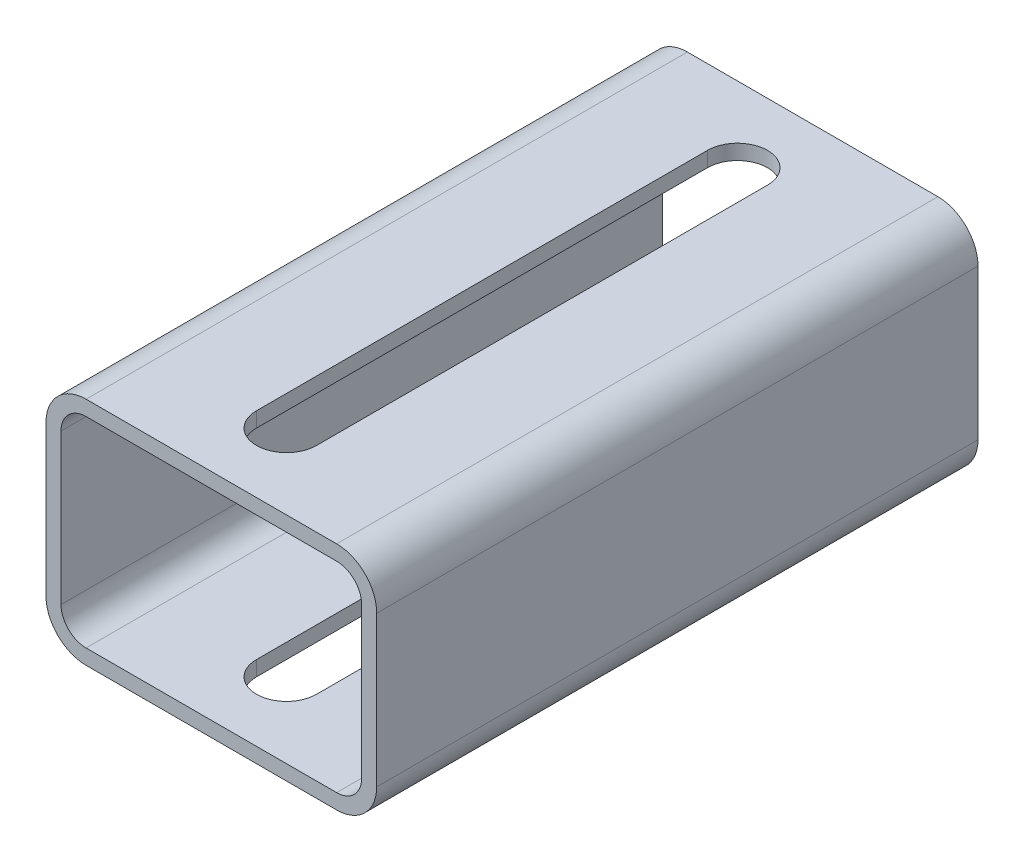
ISO-10303-21;
HEADER;
FILE_DESCRIPTION(('STEP AP214'),'2;1');
FILE_NAME('part.step','',(''),(''),'','','');
FILE_SCHEMA(('AUTOMOTIVE_DESIGN { 1 0 10303 214 1 1 1 1 }'));
ENDSEC;
DATA;
#1=APPLICATION_CONTEXT('core data for automotive mechanical design processes');
#2=APPLICATION_PROTOCOL_DEFINITION('international standard','automotive_design',2000,#1);
#3=PRODUCT_CONTEXT('',#1,'mechanical');
#4=PRODUCT('Part','Part','',(#3));
#5=PRODUCT_RELATED_PRODUCT_CATEGORY('part','',(#4));
#6=PRODUCT_DEFINITION_FORMATION('','',#4);
#7=PRODUCT_DEFINITION_CONTEXT('part definition',#1,'design');
#8=PRODUCT_DEFINITION('design','',#6,#7);
#9=PRODUCT_DEFINITION_SHAPE('','',#8);
#10=(LENGTH_UNIT() NAMED_UNIT(*) SI_UNIT(.MILLI.,.METRE.));
#11=(NAMED_UNIT(*) PLANE_ANGLE_UNIT() SI_UNIT($,.RADIAN.));
#12=(NAMED_UNIT(*) SI_UNIT($,.STERADIAN.) SOLID_ANGLE_UNIT());
#13=UNCERTAINTY_MEASURE_WITH_UNIT(LENGTH_MEASURE(1.E-05),#10,'distance_accuracy_value','');
#14=(GEOMETRIC_REPRESENTATION_CONTEXT(3) GLOBAL_UNCERTAINTY_ASSIGNED_CONTEXT((#13)) GLOBAL_UNIT_ASSIGNED_CONTEXT((#10,
#11,#12)) REPRESENTATION_CONTEXT('',''));
#15=CARTESIAN_POINT('',(0.,0.,0.));
#16=DIRECTION('',(0.,0.,1.));
#17=DIRECTION('',(1.,0.,0.));
#18=AXIS2_PLACEMENT_3D('',#15,#16,#17);
#19=CARTESIAN_POINT('',(25.,23.,60.));
#20=DIRECTION('',(0.,1.,0.));
#21=DIRECTION('',(0.,0.,1.));
#22=AXIS2_PLACEMENT_3D('',#19,#20,#21);
#23=PLANE('',#22);
#24=CARTESIAN_POINT('',(0.,23.,-45.));
#25=DIRECTION('',(0.,1.,0.));
#26=DIRECTION('',(0.,0.,1.));
#27=AXIS2_PLACEMENT_3D('',#24,#25,#26);
#28=CIRCLE('',#27,6.);
#29=CARTESIAN_POINT('',(6.,23.,-45.));
#30=VERTEX_POINT('',#29);
#31=CARTESIAN_POINT('',(-6.,23.,-45.));
#32=VERTEX_POINT('',#31);
#33=EDGE_CURVE('E90',#30,#32,#28,.T.);
#34=ORIENTED_EDGE('',*,*,#33,.F.);
#35=DIRECTION('',(0.,0.,-1.));
#36=VECTOR('',#35,1.);
#37=CARTESIAN_POINT('',(6.,23.,-45.));
#38=LINE('',#37,#36);
#39=CARTESIAN_POINT('',(6.00000000000001,23.,45.));
#40=VERTEX_POINT('',#39);
#41=EDGE_CURVE('E136',#40,#30,#38,.T.);
#42=ORIENTED_EDGE('',*,*,#41,.F.);
#43=CARTESIAN_POINT('',(0.,23.,45.));
#44=DIRECTION('',(0.,1.,0.));
#45=DIRECTION('',(0.,0.,1.));
#46=AXIS2_PLACEMENT_3D('',#43,#44,#45);
#47=CIRCLE('',#46,6.);
#48=CARTESIAN_POINT('',(-5.99999999999999,23.,45.));
#49=VERTEX_POINT('',#48);
#50=EDGE_CURVE('E290',#49,#40,#47,.T.);
#51=ORIENTED_EDGE('',*,*,#50,.F.);
#52=DIRECTION('',(0.,0.,1.));
#53=VECTOR('',#52,1.);
#54=CARTESIAN_POINT('',(-6.,23.,-45.));
#55=LINE('',#54,#53);
#56=EDGE_CURVE('E285',#32,#49,#55,.T.);
#57=ORIENTED_EDGE('',*,*,#56,.F.);
#58=EDGE_LOOP('',(#34,#42,#51,#57));
#59=FACE_BOUND('',#58,.T.);
#60=DIRECTION('',(1.,0.,0.));
#61=VECTOR('',#60,1.);
#62=CARTESIAN_POINT('',(25.,23.,-60.));
#63=LINE('',#62,#61);
#64=CARTESIAN_POINT('',(-25.,23.,-60.));
#65=VERTEX_POINT('',#64);
#66=CARTESIAN_POINT('',(25.,23.,-60.));
#67=VERTEX_POINT('',#66);
#68=EDGE_CURVE('E370',#65,#67,#63,.T.);
#69=ORIENTED_EDGE('',*,*,#68,.F.);
#70=DIRECTION('',(0.,0.,-1.));
#71=VECTOR('',#70,1.);
#72=CARTESIAN_POINT('',(-25.,23.,60.));
#73=LINE('',#72,#71);
#74=CARTESIAN_POINT('',(-25.,23.,60.));
#75=VERTEX_POINT('',#74);
#76=EDGE_CURVE('E272',#75,#65,#73,.T.);
#77=ORIENTED_EDGE('',*,*,#76,.F.);
#78=DIRECTION('',(1.,0.,0.));
#79=VECTOR('',#78,1.);
#80=CARTESIAN_POINT('',(25.,23.,60.));
#81=LINE('',#80,#79);
#82=CARTESIAN_POINT('',(25.,23.,60.));
#83=VERTEX_POINT('',#82);
#84=EDGE_CURVE('E392',#75,#83,#81,.T.);
#85=ORIENTED_EDGE('',*,*,#84,.T.);
#86=DIRECTION('',(0.,0.,-1.));
#87=VECTOR('',#86,1.);
#88=CARTESIAN_POINT('',(25.,23.,60.));
#89=LINE('',#88,#87);
#90=EDGE_CURVE('E280',#83,#67,#89,.T.);
#91=ORIENTED_EDGE('',*,*,#90,.T.);
#92=EDGE_LOOP('',(#69,#77,#85,#91));
#93=FACE_BOUND('',#92,.T.);
#94=ADVANCED_FACE('F87',(#59,#93),#23,.T.);
#95=CARTESIAN_POINT('',(-25.,15.,60.));
#96=DIRECTION('',(0.,0.,-1.));
#97=DIRECTION('',(-1.,0.,0.));
#98=AXIS2_PLACEMENT_3D('',#95,#96,#97);
#99=CYLINDRICAL_SURFACE('',#98,8.);
#100=CARTESIAN_POINT('',(-25.,15.,-60.));
#101=DIRECTION('',(0.,0.,-1.));
#102=DIRECTION('',(-1.,0.,0.));
#103=AXIS2_PLACEMENT_3D('',#100,#101,#102);
#104=CIRCLE('',#103,8.);
#105=CARTESIAN_POINT('',(-33.,15.,-60.));
#106=VERTEX_POINT('',#105);
#107=EDGE_CURVE('E397',#106,#65,#104,.T.);
#108=ORIENTED_EDGE('',*,*,#107,.F.);
#109=DIRECTION('',(0.,0.,-1.));
#110=VECTOR('',#109,1.);
#111=CARTESIAN_POINT('',(-33.,15.,60.));
#112=LINE('',#111,#110);
#113=CARTESIAN_POINT('',(-33.,15.,60.));
#114=VERTEX_POINT('',#113);
#115=EDGE_CURVE('E277',#114,#106,#112,.T.);
#116=ORIENTED_EDGE('',*,*,#115,.F.);
#117=CARTESIAN_POINT('',(-25.,15.,60.));
#118=DIRECTION('',(0.,0.,-1.));
#119=DIRECTION('',(-1.,0.,0.));
#120=AXIS2_PLACEMENT_3D('',#117,#118,#119);
#121=CIRCLE('',#120,8.);
#122=EDGE_CURVE('E418',#114,#75,#121,.T.);
#123=ORIENTED_EDGE('',*,*,#122,.T.);
#124=ORIENTED_EDGE('',*,*,#76,.T.);
#125=EDGE_LOOP('',(#108,#116,#123,#124));
#126=FACE_BOUND('',#125,.T.);
#127=ADVANCED_FACE('F482',(#126),#99,.T.);
#128=CARTESIAN_POINT('',(-33.,15.,60.));
#129=DIRECTION('',(-1.,0.,0.));
#130=DIRECTION('',(0.,0.,1.));
#131=AXIS2_PLACEMENT_3D('',#128,#129,#130);
#132=PLANE('',#131);
#133=DIRECTION('',(0.,1.,0.));
#134=VECTOR('',#133,1.);
#135=CARTESIAN_POINT('',(-33.,15.,-60.));
#136=LINE('',#135,#134);
#137=CARTESIAN_POINT('',(-33.,-15.,-60.));
#138=VERTEX_POINT('',#137);
#139=EDGE_CURVE('E443',#138,#106,#136,.T.);
#140=ORIENTED_EDGE('',*,*,#139,.F.);
#141=DIRECTION('',(0.,0.,-1.));
#142=VECTOR('',#141,1.);
#143=CARTESIAN_POINT('',(-33.,-15.,60.));
#144=LINE('',#143,#142);
#145=CARTESIAN_POINT('',(-33.,-15.,60.));
#146=VERTEX_POINT('',#145);
#147=EDGE_CURVE('E452',#146,#138,#144,.T.);
#148=ORIENTED_EDGE('',*,*,#147,.F.);
#149=DIRECTION('',(0.,1.,0.));
#150=VECTOR('',#149,1.);
#151=CARTESIAN_POINT('',(-33.,15.,60.));
#152=LINE('',#151,#150);
#153=EDGE_CURVE('E414',#146,#114,#152,.T.);
#154=ORIENTED_EDGE('',*,*,#153,.T.);
#155=ORIENTED_EDGE('',*,*,#115,.T.);
#156=EDGE_LOOP('',(#140,#148,#154,#155));
#157=FACE_BOUND('',#156,.T.);
#158=ADVANCED_FACE('F505',(#157),#132,.T.);
#159=CARTESIAN_POINT('',(-25.,-15.,60.));
#160=DIRECTION('',(0.,0.,-1.));
#161=DIRECTION('',(-1.,0.,0.));
#162=AXIS2_PLACEMENT_3D('',#159,#160,#161);
#163=CYLINDRICAL_SURFACE('',#162,8.);
#164=CARTESIAN_POINT('',(-25.,-15.,-60.));
#165=DIRECTION('',(0.,0.,-1.));
#166=DIRECTION('',(-1.,0.,0.));
#167=AXIS2_PLACEMENT_3D('',#164,#165,#166);
#168=CIRCLE('',#167,8.);
#169=CARTESIAN_POINT('',(-25.,-23.,-60.));
#170=VERTEX_POINT('',#169);
#171=EDGE_CURVE('E439',#170,#138,#168,.T.);
#172=ORIENTED_EDGE('',*,*,#171,.F.);
#173=DIRECTION('',(0.,0.,-1.));
#174=VECTOR('',#173,1.);
#175=CARTESIAN_POINT('',(-25.,-23.,60.));
#176=LINE('',#175,#174);
#177=CARTESIAN_POINT('',(-25.,-23.,60.));
#178=VERTEX_POINT('',#177);
#179=EDGE_CURVE('E455',#178,#170,#176,.T.);
#180=ORIENTED_EDGE('',*,*,#179,.F.);
#181=CARTESIAN_POINT('',(-25.,-15.,60.));
#182=DIRECTION('',(0.,0.,-1.));
#183=DIRECTION('',(-1.,0.,0.));
#184=AXIS2_PLACEMENT_3D('',#181,#182,#183);
#185=CIRCLE('',#184,8.);
#186=EDGE_CURVE('E410',#178,#146,#185,.T.);
#187=ORIENTED_EDGE('',*,*,#186,.T.);
#188=ORIENTED_EDGE('',*,*,#147,.T.);
#189=EDGE_LOOP('',(#172,#180,#187,#188));
#190=FACE_BOUND('',#189,.T.);
#191=ADVANCED_FACE('F503',(#190),#163,.T.);
#192=CARTESIAN_POINT('',(25.,-23.,60.));
#193=DIRECTION('',(0.,1.,0.));
#194=DIRECTION('',(-1.,0.,0.));
#195=AXIS2_PLACEMENT_3D('',#192,#193,#194);
#196=PLANE('',#195);
#197=DIRECTION('',(0.,0.,-1.));
#198=VECTOR('',#197,1.);
#199=CARTESIAN_POINT('',(6.,-23.,-45.));
#200=LINE('',#199,#198);
#201=CARTESIAN_POINT('',(6.00000000000001,-23.,45.));
#202=VERTEX_POINT('',#201);
#203=CARTESIAN_POINT('',(6.,-23.,-45.));
#204=VERTEX_POINT('',#203);
#205=EDGE_CURVE('E559',#202,#204,#200,.T.);
#206=ORIENTED_EDGE('',*,*,#205,.T.);
#207=CARTESIAN_POINT('',(0.,-23.,-45.));
#208=DIRECTION('',(0.,1.,0.));
#209=DIRECTION('',(0.,0.,1.));
#210=AXIS2_PLACEMENT_3D('',#207,#208,#209);
#211=CIRCLE('',#210,6.);
#212=CARTESIAN_POINT('',(-6.,-23.,-45.));
#213=VERTEX_POINT('',#212);
#214=EDGE_CURVE('E565',#204,#213,#211,.T.);
#215=ORIENTED_EDGE('',*,*,#214,.T.);
#216=DIRECTION('',(0.,0.,1.));
#217=VECTOR('',#216,1.);
#218=CARTESIAN_POINT('',(-6.,-23.,-45.));
#219=LINE('',#218,#217);
#220=CARTESIAN_POINT('',(-5.99999999999999,-23.,45.));
#221=VERTEX_POINT('',#220);
#222=EDGE_CURVE('E252',#213,#221,#219,.T.);
#223=ORIENTED_EDGE('',*,*,#222,.T.);
#224=CARTESIAN_POINT('',(0.,-23.,45.));
#225=DIRECTION('',(0.,1.,0.));
#226=DIRECTION('',(0.,0.,1.));
#227=AXIS2_PLACEMENT_3D('',#224,#225,#226);
#228=CIRCLE('',#227,6.);
#229=EDGE_CURVE('E113',#221,#202,#228,.T.);
#230=ORIENTED_EDGE('',*,*,#229,.T.);
#231=EDGE_LOOP('',(#206,#215,#223,#230));
#232=FACE_BOUND('',#231,.T.);
#233=DIRECTION('',(1.,0.,0.));
#234=VECTOR('',#233,1.);
#235=CARTESIAN_POINT('',(25.,-23.,-60.));
#236=LINE('',#235,#234);
#237=CARTESIAN_POINT('',(25.,-23.,-60.));
#238=VERTEX_POINT('',#237);
#239=EDGE_CURVE('E436',#170,#238,#236,.T.);
#240=ORIENTED_EDGE('',*,*,#239,.T.);
#241=DIRECTION('',(0.,0.,-1.));
#242=VECTOR('',#241,1.);
#243=CARTESIAN_POINT('',(25.,-23.,60.));
#244=LINE('',#243,#242);
#245=CARTESIAN_POINT('',(25.,-23.,60.));
#246=VERTEX_POINT('',#245);
#247=EDGE_CURVE('E458',#246,#238,#244,.T.);
#248=ORIENTED_EDGE('',*,*,#247,.F.);
#249=DIRECTION('',(1.,0.,0.));
#250=VECTOR('',#249,1.);
#251=CARTESIAN_POINT('',(25.,-23.,60.));
#252=LINE('',#251,#250);
#253=EDGE_CURVE('E407',#178,#246,#252,.T.);
#254=ORIENTED_EDGE('',*,*,#253,.F.);
#255=ORIENTED_EDGE('',*,*,#179,.T.);
#256=EDGE_LOOP('',(#240,#248,#254,#255));
#257=FACE_BOUND('',#256,.T.);
#258=ADVANCED_FACE('F500',(#232,#257),#196,.F.);
#259=CARTESIAN_POINT('',(25.,-15.,60.));
#260=DIRECTION('',(0.,0.,-1.));
#261=DIRECTION('',(-1.,0.,0.));
#262=AXIS2_PLACEMENT_3D('',#259,#260,#261);
#263=CYLINDRICAL_SURFACE('',#262,8.00000000000001);
#264=CARTESIAN_POINT('',(25.,-15.,-60.));
#265=DIRECTION('',(0.,0.,-1.));
#266=DIRECTION('',(-1.,0.,0.));
#267=AXIS2_PLACEMENT_3D('',#264,#265,#266);
#268=CIRCLE('',#267,8.00000000000001);
#269=CARTESIAN_POINT('',(33.,-15.,-60.));
#270=VERTEX_POINT('',#269);
#271=EDGE_CURVE('E433',#238,#270,#268,.F.);
#272=ORIENTED_EDGE('',*,*,#271,.T.);
#273=DIRECTION('',(0.,0.,-1.));
#274=VECTOR('',#273,1.);
#275=CARTESIAN_POINT('',(33.,-15.,60.));
#276=LINE('',#275,#274);
#277=CARTESIAN_POINT('',(33.,-15.,60.));
#278=VERTEX_POINT('',#277);
#279=EDGE_CURVE('E462',#278,#270,#276,.T.);
#280=ORIENTED_EDGE('',*,*,#279,.F.);
#281=CARTESIAN_POINT('',(25.,-15.,60.));
#282=DIRECTION('',(0.,0.,-1.));
#283=DIRECTION('',(-1.,0.,0.));
#284=AXIS2_PLACEMENT_3D('',#281,#282,#283);
#285=CIRCLE('',#284,8.00000000000001);
#286=EDGE_CURVE('E404',#246,#278,#285,.F.);
#287=ORIENTED_EDGE('',*,*,#286,.F.);
#288=ORIENTED_EDGE('',*,*,#247,.T.);
#289=EDGE_LOOP('',(#272,#280,#287,#288));
#290=FACE_BOUND('',#289,.T.);
#291=ADVANCED_FACE('F496',(#290),#263,.T.);
#292=CARTESIAN_POINT('',(33.,15.,60.));
#293=DIRECTION('',(-1.,0.,0.));
#294=DIRECTION('',(0.,0.,1.));
#295=AXIS2_PLACEMENT_3D('',#292,#293,#294);
#296=PLANE('',#295);
#297=DIRECTION('',(0.,1.,0.));
#298=VECTOR('',#297,1.);
#299=CARTESIAN_POINT('',(33.,15.,-60.));
#300=LINE('',#299,#298);
#301=CARTESIAN_POINT('',(33.,15.,-60.));
#302=VERTEX_POINT('',#301);
#303=EDGE_CURVE('E429',#270,#302,#300,.T.);
#304=ORIENTED_EDGE('',*,*,#303,.T.);
#305=DIRECTION('',(0.,0.,-1.));
#306=VECTOR('',#305,1.);
#307=CARTESIAN_POINT('',(33.,15.,60.));
#308=LINE('',#307,#306);
#309=CARTESIAN_POINT('',(33.,15.,60.));
#310=VERTEX_POINT('',#309);
#311=EDGE_CURVE('E465',#310,#302,#308,.T.);
#312=ORIENTED_EDGE('',*,*,#311,.F.);
#313=DIRECTION('',(0.,1.,0.));
#314=VECTOR('',#313,1.);
#315=CARTESIAN_POINT('',(33.,15.,60.));
#316=LINE('',#315,#314);
#317=EDGE_CURVE('E401',#278,#310,#316,.T.);
#318=ORIENTED_EDGE('',*,*,#317,.F.);
#319=ORIENTED_EDGE('',*,*,#279,.T.);
#320=EDGE_LOOP('',(#304,#312,#318,#319));
#321=FACE_BOUND('',#320,.T.);
#322=ADVANCED_FACE('F491',(#321),#296,.F.);
#323=CARTESIAN_POINT('',(25.,15.,60.));
#324=DIRECTION('',(0.,0.,-1.));
#325=DIRECTION('',(-1.,0.,0.));
#326=AXIS2_PLACEMENT_3D('',#323,#324,#325);
#327=CYLINDRICAL_SURFACE('',#326,8.00000000000001);
#328=CARTESIAN_POINT('',(25.,15.,-60.));
#329=DIRECTION('',(0.,0.,-1.));
#330=DIRECTION('',(-1.,0.,0.));
#331=AXIS2_PLACEMENT_3D('',#328,#329,#330);
#332=CIRCLE('',#331,8.00000000000001);
#333=EDGE_CURVE('E425',#67,#302,#332,.T.);
#334=ORIENTED_EDGE('',*,*,#333,.F.);
#335=ORIENTED_EDGE('',*,*,#90,.F.);
#336=CARTESIAN_POINT('',(25.,15.,60.));
#337=DIRECTION('',(0.,0.,-1.));
#338=DIRECTION('',(-1.,0.,0.));
#339=AXIS2_PLACEMENT_3D('',#336,#337,#338);
#340=CIRCLE('',#339,8.00000000000001);
#341=EDGE_CURVE('E396',#83,#310,#340,.T.);
#342=ORIENTED_EDGE('',*,*,#341,.T.);
#343=ORIENTED_EDGE('',*,*,#311,.T.);
#344=EDGE_LOOP('',(#334,#335,#342,#343));
#345=FACE_BOUND('',#344,.T.);
#346=ADVANCED_FACE('F475',(#345),#327,.T.);
#347=CARTESIAN_POINT('',(25.,15.,60.));
#348=DIRECTION('',(0.,0.,-1.));
#349=DIRECTION('',(-1.,0.,0.));
#350=AXIS2_PLACEMENT_3D('',#347,#348,#349);
#351=PLANE('',#350);
#352=CARTESIAN_POINT('',(-25.,15.,60.));
#353=DIRECTION('',(0.,0.,-1.));
#354=DIRECTION('',(-1.,0.,0.));
#355=AXIS2_PLACEMENT_3D('',#352,#353,#354);
#356=CIRCLE('',#355,5.);
#357=CARTESIAN_POINT('',(-30.,15.,60.));
#358=VERTEX_POINT('',#357);
#359=CARTESIAN_POINT('',(-25.,20.,60.));
#360=VERTEX_POINT('',#359);
#361=EDGE_CURVE('E332',#358,#360,#356,.T.);
#362=ORIENTED_EDGE('',*,*,#361,.T.);
#363=DIRECTION('',(1.,0.,0.));
#364=VECTOR('',#363,1.);
#365=CARTESIAN_POINT('',(-25.,20.,60.));
#366=LINE('',#365,#364);
#367=CARTESIAN_POINT('',(25.,20.,60.));
#368=VERTEX_POINT('',#367);
#369=EDGE_CURVE('E305',#360,#368,#366,.T.);
#370=ORIENTED_EDGE('',*,*,#369,.T.);
#371=CARTESIAN_POINT('',(25.,15.,60.));
#372=DIRECTION('',(0.,0.,-1.));
#373=DIRECTION('',(-1.,0.,0.));
#374=AXIS2_PLACEMENT_3D('',#371,#372,#373);
#375=CIRCLE('',#374,5.00000000000001);
#376=CARTESIAN_POINT('',(30.,15.,60.));
#377=VERTEX_POINT('',#376);
#378=EDGE_CURVE('E309',#368,#377,#375,.T.);
#379=ORIENTED_EDGE('',*,*,#378,.T.);
#380=DIRECTION('',(0.,1.,0.));
#381=VECTOR('',#380,1.);
#382=CARTESIAN_POINT('',(30.,-15.,60.));
#383=LINE('',#382,#381);
#384=CARTESIAN_POINT('',(30.,-15.,60.));
#385=VERTEX_POINT('',#384);
#386=EDGE_CURVE('E314',#385,#377,#383,.T.);
#387=ORIENTED_EDGE('',*,*,#386,.F.);
#388=CARTESIAN_POINT('',(25.,-15.,60.));
#389=DIRECTION('',(0.,0.,1.));
#390=DIRECTION('',(1.,0.,0.));
#391=AXIS2_PLACEMENT_3D('',#388,#389,#390);
#392=CIRCLE('',#391,5.00000000000001);
#393=CARTESIAN_POINT('',(25.,-20.,60.));
#394=VERTEX_POINT('',#393);
#395=EDGE_CURVE('E318',#394,#385,#392,.T.);
#396=ORIENTED_EDGE('',*,*,#395,.F.);
#397=DIRECTION('',(1.,0.,0.));
#398=VECTOR('',#397,1.);
#399=CARTESIAN_POINT('',(-25.,-20.,60.));
#400=LINE('',#399,#398);
#401=CARTESIAN_POINT('',(-25.,-20.,60.));
#402=VERTEX_POINT('',#401);
#403=EDGE_CURVE('E321',#402,#394,#400,.T.);
#404=ORIENTED_EDGE('',*,*,#403,.F.);
#405=CARTESIAN_POINT('',(-25.,-15.,60.));
#406=DIRECTION('',(0.,0.,-1.));
#407=DIRECTION('',(-1.,0.,0.));
#408=AXIS2_PLACEMENT_3D('',#405,#406,#407);
#409=CIRCLE('',#408,5.);
#410=CARTESIAN_POINT('',(-30.,-15.,60.));
#411=VERTEX_POINT('',#410);
#412=EDGE_CURVE('E324',#402,#411,#409,.T.);
#413=ORIENTED_EDGE('',*,*,#412,.T.);
#414=DIRECTION('',(0.,1.,0.));
#415=VECTOR('',#414,1.);
#416=CARTESIAN_POINT('',(-30.,-15.,60.));
#417=LINE('',#416,#415);
#418=EDGE_CURVE('E328',#411,#358,#417,.T.);
#419=ORIENTED_EDGE('',*,*,#418,.T.);
#420=EDGE_LOOP('',(#362,#370,#379,#387,#396,#404,#413,#419));
#421=FACE_BOUND('',#420,.T.);
#422=ORIENTED_EDGE('',*,*,#84,.F.);
#423=ORIENTED_EDGE('',*,*,#122,.F.);
#424=ORIENTED_EDGE('',*,*,#153,.F.);
#425=ORIENTED_EDGE('',*,*,#186,.F.);
#426=ORIENTED_EDGE('',*,*,#253,.T.);
#427=ORIENTED_EDGE('',*,*,#286,.T.);
#428=ORIENTED_EDGE('',*,*,#317,.T.);
#429=ORIENTED_EDGE('',*,*,#341,.F.);
#430=EDGE_LOOP('',(#422,#423,#424,#425,#426,#427,#428,#429));
#431=FACE_BOUND('',#430,.T.);
#432=ADVANCED_FACE('F485',(#421,#431),#351,.F.);
#433=CARTESIAN_POINT('',(25.,15.,-60.));
#434=DIRECTION('',(0.,0.,-1.));
#435=DIRECTION('',(-1.,0.,0.));
#436=AXIS2_PLACEMENT_3D('',#433,#434,#435);
#437=PLANE('',#436);
#438=DIRECTION('',(1.,0.,0.));
#439=VECTOR('',#438,1.);
#440=CARTESIAN_POINT('',(-25.,20.,-60.));
#441=LINE('',#440,#439);
#442=CARTESIAN_POINT('',(-25.,20.,-60.));
#443=VERTEX_POINT('',#442);
#444=CARTESIAN_POINT('',(25.,20.,-60.));
#445=VERTEX_POINT('',#444);
#446=EDGE_CURVE('E337',#443,#445,#441,.T.);
#447=ORIENTED_EDGE('',*,*,#446,.F.);
#448=CARTESIAN_POINT('',(-25.,15.,-60.));
#449=DIRECTION('',(0.,0.,-1.));
#450=DIRECTION('',(-1.,0.,0.));
#451=AXIS2_PLACEMENT_3D('',#448,#449,#450);
#452=CIRCLE('',#451,5.);
#453=CARTESIAN_POINT('',(-30.,15.,-60.));
#454=VERTEX_POINT('',#453);
#455=EDGE_CURVE('E310',#454,#443,#452,.T.);
#456=ORIENTED_EDGE('',*,*,#455,.F.);
#457=DIRECTION('',(0.,1.,0.));
#458=VECTOR('',#457,1.);
#459=CARTESIAN_POINT('',(-30.,-15.,-60.));
#460=LINE('',#459,#458);
#461=CARTESIAN_POINT('',(-30.,-15.,-60.));
#462=VERTEX_POINT('',#461);
#463=EDGE_CURVE('E360',#462,#454,#460,.T.);
#464=ORIENTED_EDGE('',*,*,#463,.F.);
#465=CARTESIAN_POINT('',(-25.,-15.,-60.));
#466=DIRECTION('',(0.,0.,-1.));
#467=DIRECTION('',(-1.,0.,0.));
#468=AXIS2_PLACEMENT_3D('',#465,#466,#467);
#469=CIRCLE('',#468,5.);
#470=CARTESIAN_POINT('',(-25.,-20.,-60.));
#471=VERTEX_POINT('',#470);
#472=EDGE_CURVE('E356',#471,#462,#469,.T.);
#473=ORIENTED_EDGE('',*,*,#472,.F.);
#474=DIRECTION('',(1.,0.,0.));
#475=VECTOR('',#474,1.);
#476=CARTESIAN_POINT('',(-25.,-20.,-60.));
#477=LINE('',#476,#475);
#478=CARTESIAN_POINT('',(25.,-20.,-60.));
#479=VERTEX_POINT('',#478);
#480=EDGE_CURVE('E352',#471,#479,#477,.T.);
#481=ORIENTED_EDGE('',*,*,#480,.T.);
#482=CARTESIAN_POINT('',(25.,-15.,-60.));
#483=DIRECTION('',(0.,0.,1.));
#484=DIRECTION('',(1.,0.,0.));
#485=AXIS2_PLACEMENT_3D('',#482,#483,#484);
#486=CIRCLE('',#485,5.00000000000001);
#487=CARTESIAN_POINT('',(30.,-15.,-60.));
#488=VERTEX_POINT('',#487);
#489=EDGE_CURVE('E348',#479,#488,#486,.T.);
#490=ORIENTED_EDGE('',*,*,#489,.T.);
#491=DIRECTION('',(0.,1.,0.));
#492=VECTOR('',#491,1.);
#493=CARTESIAN_POINT('',(30.,-15.,-60.));
#494=LINE('',#493,#492);
#495=CARTESIAN_POINT('',(30.,15.,-60.));
#496=VERTEX_POINT('',#495);
#497=EDGE_CURVE('E344',#488,#496,#494,.T.);
#498=ORIENTED_EDGE('',*,*,#497,.T.);
#499=CARTESIAN_POINT('',(25.,15.,-60.));
#500=DIRECTION('',(0.,0.,-1.));
#501=DIRECTION('',(-1.,0.,0.));
#502=AXIS2_PLACEMENT_3D('',#499,#500,#501);
#503=CIRCLE('',#502,5.00000000000001);
#504=EDGE_CURVE('E340',#445,#496,#503,.T.);
#505=ORIENTED_EDGE('',*,*,#504,.F.);
#506=EDGE_LOOP('',(#447,#456,#464,#473,#481,#490,#498,#505));
#507=FACE_BOUND('',#506,.T.);
#508=ORIENTED_EDGE('',*,*,#68,.T.);
#509=ORIENTED_EDGE('',*,*,#333,.T.);
#510=ORIENTED_EDGE('',*,*,#303,.F.);
#511=ORIENTED_EDGE('',*,*,#271,.F.);
#512=ORIENTED_EDGE('',*,*,#239,.F.);
#513=ORIENTED_EDGE('',*,*,#171,.T.);
#514=ORIENTED_EDGE('',*,*,#139,.T.);
#515=ORIENTED_EDGE('',*,*,#107,.T.);
#516=EDGE_LOOP('',(#508,#509,#510,#511,#512,#513,#514,#515));
#517=FACE_BOUND('',#516,.T.);
#518=ADVANCED_FACE('F478',(#507,#517),#437,.T.);
#519=CARTESIAN_POINT('',(-25.,20.,60.));
#520=DIRECTION('',(0.,1.,0.));
#521=DIRECTION('',(0.,0.,1.));
#522=AXIS2_PLACEMENT_3D('',#519,#520,#521);
#523=PLANE('',#522);
#524=DIRECTION('',(0.,0.,-1.));
#525=VECTOR('',#524,1.);
#526=CARTESIAN_POINT('',(6.00000000000002,20.,60.));
#527=LINE('',#526,#525);
#528=CARTESIAN_POINT('',(6.00000000000001,20.,45.));
#529=VERTEX_POINT('',#528);
#530=CARTESIAN_POINT('',(6.,20.,-45.));
#531=VERTEX_POINT('',#530);
#532=EDGE_CURVE('E292',#529,#531,#527,.T.);
#533=ORIENTED_EDGE('',*,*,#532,.T.);
#534=CARTESIAN_POINT('',(0.,20.,-45.));
#535=DIRECTION('',(0.,1.,0.));
#536=DIRECTION('',(0.,0.,1.));
#537=AXIS2_PLACEMENT_3D('',#534,#535,#536);
#538=CIRCLE('',#537,6.);
#539=CARTESIAN_POINT('',(-6.,20.,-45.));
#540=VERTEX_POINT('',#539);
#541=EDGE_CURVE('E145',#531,#540,#538,.T.);
#542=ORIENTED_EDGE('',*,*,#541,.T.);
#543=DIRECTION('',(0.,0.,1.));
#544=VECTOR('',#543,1.);
#545=CARTESIAN_POINT('',(-5.99999999999999,20.,60.));
#546=LINE('',#545,#544);
#547=CARTESIAN_POINT('',(-5.99999999999999,20.,45.));
#548=VERTEX_POINT('',#547);
#549=EDGE_CURVE('E289',#540,#548,#546,.T.);
#550=ORIENTED_EDGE('',*,*,#549,.T.);
#551=CARTESIAN_POINT('',(0.,20.,45.));
#552=DIRECTION('',(0.,1.,0.));
#553=DIRECTION('',(0.,0.,1.));
#554=AXIS2_PLACEMENT_3D('',#551,#552,#553);
#555=CIRCLE('',#554,6.);
#556=EDGE_CURVE('E288',#548,#529,#555,.T.);
#557=ORIENTED_EDGE('',*,*,#556,.T.);
#558=EDGE_LOOP('',(#533,#542,#550,#557));
#559=FACE_BOUND('',#558,.T.);
#560=ORIENTED_EDGE('',*,*,#446,.T.);
#561=DIRECTION('',(0.,0.,-1.));
#562=VECTOR('',#561,1.);
#563=CARTESIAN_POINT('',(25.,20.,60.));
#564=LINE('',#563,#562);
#565=EDGE_CURVE('E336',#368,#445,#564,.T.);
#566=ORIENTED_EDGE('',*,*,#565,.F.);
#567=ORIENTED_EDGE('',*,*,#369,.F.);
#568=DIRECTION('',(0.,0.,-1.));
#569=VECTOR('',#568,1.);
#570=CARTESIAN_POINT('',(-25.,20.,60.));
#571=LINE('',#570,#569);
#572=EDGE_CURVE('E367',#360,#443,#571,.T.);
#573=ORIENTED_EDGE('',*,*,#572,.T.);
#574=EDGE_LOOP('',(#560,#566,#567,#573));
#575=FACE_BOUND('',#574,.T.);
#576=ADVANCED_FACE('F539',(#559,#575),#523,.F.);
#577=CARTESIAN_POINT('',(-25.,15.,60.));
#578=DIRECTION('',(0.,0.,-1.));
#579=DIRECTION('',(-1.,0.,0.));
#580=AXIS2_PLACEMENT_3D('',#577,#578,#579);
#581=CYLINDRICAL_SURFACE('',#580,5.);
#582=ORIENTED_EDGE('',*,*,#455,.T.);
#583=ORIENTED_EDGE('',*,*,#572,.F.);
#584=ORIENTED_EDGE('',*,*,#361,.F.);
#585=DIRECTION('',(0.,0.,-1.));
#586=VECTOR('',#585,1.);
#587=CARTESIAN_POINT('',(-30.,15.,60.));
#588=LINE('',#587,#586);
#589=EDGE_CURVE('E371',#358,#454,#588,.T.);
#590=ORIENTED_EDGE('',*,*,#589,.T.);
#591=EDGE_LOOP('',(#582,#583,#584,#590));
#592=FACE_BOUND('',#591,.T.);
#593=ADVANCED_FACE('F591',(#592),#581,.F.);
#594=CARTESIAN_POINT('',(-30.,-15.,60.));
#595=DIRECTION('',(-1.,0.,0.));
#596=DIRECTION('',(0.,0.,1.));
#597=AXIS2_PLACEMENT_3D('',#594,#595,#596);
#598=PLANE('',#597);
#599=ORIENTED_EDGE('',*,*,#463,.T.);
#600=ORIENTED_EDGE('',*,*,#589,.F.);
#601=ORIENTED_EDGE('',*,*,#418,.F.);
#602=DIRECTION('',(0.,0.,-1.));
#603=VECTOR('',#602,1.);
#604=CARTESIAN_POINT('',(-30.,-15.,60.));
#605=LINE('',#604,#603);
#606=EDGE_CURVE('E374',#411,#462,#605,.T.);
#607=ORIENTED_EDGE('',*,*,#606,.T.);
#608=EDGE_LOOP('',(#599,#600,#601,#607));
#609=FACE_BOUND('',#608,.T.);
#610=ADVANCED_FACE('F594',(#609),#598,.F.);
#611=CARTESIAN_POINT('',(-25.,-15.,60.));
#612=DIRECTION('',(0.,0.,-1.));
#613=DIRECTION('',(-1.,0.,0.));
#614=AXIS2_PLACEMENT_3D('',#611,#612,#613);
#615=CYLINDRICAL_SURFACE('',#614,5.);
#616=ORIENTED_EDGE('',*,*,#472,.T.);
#617=ORIENTED_EDGE('',*,*,#606,.F.);
#618=ORIENTED_EDGE('',*,*,#412,.F.);
#619=DIRECTION('',(0.,0.,-1.));
#620=VECTOR('',#619,1.);
#621=CARTESIAN_POINT('',(-25.,-20.,60.));
#622=LINE('',#621,#620);
#623=EDGE_CURVE('E377',#402,#471,#622,.T.);
#624=ORIENTED_EDGE('',*,*,#623,.T.);
#625=EDGE_LOOP('',(#616,#617,#618,#624));
#626=FACE_BOUND('',#625,.T.);
#627=ADVANCED_FACE('F598',(#626),#615,.F.);
#628=CARTESIAN_POINT('',(-25.,-20.,60.));
#629=DIRECTION('',(0.,1.,0.));
#630=DIRECTION('',(-1.,0.,0.));
#631=AXIS2_PLACEMENT_3D('',#628,#629,#630);
#632=PLANE('',#631);
#633=CARTESIAN_POINT('',(0.,-20.,-45.));
#634=DIRECTION('',(0.,1.,0.));
#635=DIRECTION('',(-1.,0.,0.));
#636=AXIS2_PLACEMENT_3D('',#633,#634,#635);
#637=CIRCLE('',#636,6.);
#638=CARTESIAN_POINT('',(6.,-20.,-45.));
#639=VERTEX_POINT('',#638);
#640=CARTESIAN_POINT('',(-6.,-20.,-45.));
#641=VERTEX_POINT('',#640);
#642=EDGE_CURVE('E12',#639,#641,#637,.T.);
#643=ORIENTED_EDGE('',*,*,#642,.F.);
#644=DIRECTION('',(0.,0.,-1.));
#645=VECTOR('',#644,1.);
#646=CARTESIAN_POINT('',(6.00000000000002,-20.,60.));
#647=LINE('',#646,#645);
#648=CARTESIAN_POINT('',(6.00000000000001,-20.,45.));
#649=VERTEX_POINT('',#648);
#650=EDGE_CURVE('E96',#649,#639,#647,.T.);
#651=ORIENTED_EDGE('',*,*,#650,.F.);
#652=CARTESIAN_POINT('',(0.,-20.,45.));
#653=DIRECTION('',(0.,1.,0.));
#654=DIRECTION('',(-1.,0.,0.));
#655=AXIS2_PLACEMENT_3D('',#652,#653,#654);
#656=CIRCLE('',#655,6.);
#657=CARTESIAN_POINT('',(-5.99999999999999,-20.,45.));
#658=VERTEX_POINT('',#657);
#659=EDGE_CURVE('E270',#658,#649,#656,.T.);
#660=ORIENTED_EDGE('',*,*,#659,.F.);
#661=DIRECTION('',(0.,0.,1.));
#662=VECTOR('',#661,1.);
#663=CARTESIAN_POINT('',(-5.99999999999999,-20.,60.));
#664=LINE('',#663,#662);
#665=EDGE_CURVE('E249',#641,#658,#664,.T.);
#666=ORIENTED_EDGE('',*,*,#665,.F.);
#667=EDGE_LOOP('',(#643,#651,#660,#666));
#668=FACE_BOUND('',#667,.T.);
#669=ORIENTED_EDGE('',*,*,#480,.F.);
#670=ORIENTED_EDGE('',*,*,#623,.F.);
#671=ORIENTED_EDGE('',*,*,#403,.T.);
#672=DIRECTION('',(0.,0.,-1.));
#673=VECTOR('',#672,1.);
#674=CARTESIAN_POINT('',(25.,-20.,60.));
#675=LINE('',#674,#673);
#676=EDGE_CURVE('E380',#394,#479,#675,.T.);
#677=ORIENTED_EDGE('',*,*,#676,.T.);
#678=EDGE_LOOP('',(#669,#670,#671,#677));
#679=FACE_BOUND('',#678,.T.);
#680=ADVANCED_FACE('F267',(#668,#679),#632,.T.);
#681=CARTESIAN_POINT('',(25.,-15.,60.));
#682=DIRECTION('',(0.,0.,-1.));
#683=DIRECTION('',(-1.,0.,0.));
#684=AXIS2_PLACEMENT_3D('',#681,#682,#683);
#685=CYLINDRICAL_SURFACE('',#684,5.00000000000001);
#686=ORIENTED_EDGE('',*,*,#489,.F.);
#687=ORIENTED_EDGE('',*,*,#676,.F.);
#688=ORIENTED_EDGE('',*,*,#395,.T.);
#689=DIRECTION('',(0.,0.,-1.));
#690=VECTOR('',#689,1.);
#691=CARTESIAN_POINT('',(30.,-15.,60.));
#692=LINE('',#691,#690);
#693=EDGE_CURVE('E383',#385,#488,#692,.T.);
#694=ORIENTED_EDGE('',*,*,#693,.T.);
#695=EDGE_LOOP('',(#686,#687,#688,#694));
#696=FACE_BOUND('',#695,.T.);
#697=ADVANCED_FACE('F605',(#696),#685,.F.);
#698=CARTESIAN_POINT('',(30.,-15.,60.));
#699=DIRECTION('',(-1.,0.,0.));
#700=DIRECTION('',(0.,0.,1.));
#701=AXIS2_PLACEMENT_3D('',#698,#699,#700);
#702=PLANE('',#701);
#703=ORIENTED_EDGE('',*,*,#497,.F.);
#704=ORIENTED_EDGE('',*,*,#693,.F.);
#705=ORIENTED_EDGE('',*,*,#386,.T.);
#706=DIRECTION('',(0.,0.,-1.));
#707=VECTOR('',#706,1.);
#708=CARTESIAN_POINT('',(30.,15.,60.));
#709=LINE('',#708,#707);
#710=EDGE_CURVE('E386',#377,#496,#709,.T.);
#711=ORIENTED_EDGE('',*,*,#710,.T.);
#712=EDGE_LOOP('',(#703,#704,#705,#711));
#713=FACE_BOUND('',#712,.T.);
#714=ADVANCED_FACE('F608',(#713),#702,.T.);
#715=CARTESIAN_POINT('',(25.,15.,60.));
#716=DIRECTION('',(0.,0.,-1.));
#717=DIRECTION('',(-1.,0.,0.));
#718=AXIS2_PLACEMENT_3D('',#715,#716,#717);
#719=CYLINDRICAL_SURFACE('',#718,5.00000000000001);
#720=ORIENTED_EDGE('',*,*,#504,.T.);
#721=ORIENTED_EDGE('',*,*,#710,.F.);
#722=ORIENTED_EDGE('',*,*,#378,.F.);
#723=ORIENTED_EDGE('',*,*,#565,.T.);
#724=EDGE_LOOP('',(#720,#721,#722,#723));
#725=FACE_BOUND('',#724,.T.);
#726=ADVANCED_FACE('F612',(#725),#719,.F.);
#727=CARTESIAN_POINT('',(-6.,-23.,-45.));
#728=DIRECTION('',(-1.,0.,0.));
#729=DIRECTION('',(0.,0.,1.));
#730=AXIS2_PLACEMENT_3D('',#727,#728,#729);
#731=PLANE('',#730);
#732=ORIENTED_EDGE('',*,*,#665,.T.);
#733=DIRECTION('',(0.,1.,0.));
#734=VECTOR('',#733,1.);
#735=CARTESIAN_POINT('',(-5.99999999999999,-23.,45.));
#736=LINE('',#735,#734);
#737=EDGE_CURVE('E535',#221,#658,#736,.T.);
#738=ORIENTED_EDGE('',*,*,#737,.F.);
#739=ORIENTED_EDGE('',*,*,#222,.F.);
#740=DIRECTION('',(0.,1.,0.));
#741=VECTOR('',#740,1.);
#742=CARTESIAN_POINT('',(-6.,-23.,-45.));
#743=LINE('',#742,#741);
#744=EDGE_CURVE('E246',#213,#641,#743,.T.);
#745=ORIENTED_EDGE('',*,*,#744,.T.);
#746=EDGE_LOOP('',(#732,#738,#739,#745));
#747=FACE_BOUND('',#746,.T.);
#748=ADVANCED_FACE('F247',(#747),#731,.F.);
#749=CARTESIAN_POINT('',(0.,-23.,45.));
#750=DIRECTION('',(0.,1.,0.));
#751=DIRECTION('',(0.,0.,1.));
#752=AXIS2_PLACEMENT_3D('',#749,#750,#751);
#753=CYLINDRICAL_SURFACE('',#752,6.);
#754=ORIENTED_EDGE('',*,*,#659,.T.);
#755=DIRECTION('',(0.,1.,0.));
#756=VECTOR('',#755,1.);
#757=CARTESIAN_POINT('',(6.00000000000001,-23.,45.));
#758=LINE('',#757,#756);
#759=EDGE_CURVE('E526',#202,#649,#758,.T.);
#760=ORIENTED_EDGE('',*,*,#759,.F.);
#761=ORIENTED_EDGE('',*,*,#229,.F.);
#762=ORIENTED_EDGE('',*,*,#737,.T.);
#763=EDGE_LOOP('',(#754,#760,#761,#762));
#764=FACE_BOUND('',#763,.T.);
#765=ADVANCED_FACE('F571',(#764),#753,.F.);
#766=CARTESIAN_POINT('',(6.,-23.,-45.));
#767=DIRECTION('',(1.,0.,0.));
#768=DIRECTION('',(0.,0.,-1.));
#769=AXIS2_PLACEMENT_3D('',#766,#767,#768);
#770=PLANE('',#769);
#771=ORIENTED_EDGE('',*,*,#650,.T.);
#772=DIRECTION('',(0.,1.,0.));
#773=VECTOR('',#772,1.);
#774=CARTESIAN_POINT('',(6.,-23.,-45.));
#775=LINE('',#774,#773);
#776=EDGE_CURVE('E263',#204,#639,#775,.T.);
#777=ORIENTED_EDGE('',*,*,#776,.F.);
#778=ORIENTED_EDGE('',*,*,#205,.F.);
#779=ORIENTED_EDGE('',*,*,#759,.T.);
#780=EDGE_LOOP('',(#771,#777,#778,#779));
#781=FACE_BOUND('',#780,.T.);
#782=ADVANCED_FACE('F573',(#781),#770,.F.);
#783=CARTESIAN_POINT('',(0.,-23.,-45.));
#784=DIRECTION('',(0.,1.,0.));
#785=DIRECTION('',(0.,0.,1.));
#786=AXIS2_PLACEMENT_3D('',#783,#784,#785);
#787=CYLINDRICAL_SURFACE('',#786,6.);
#788=ORIENTED_EDGE('',*,*,#642,.T.);
#789=ORIENTED_EDGE('',*,*,#744,.F.);
#790=ORIENTED_EDGE('',*,*,#214,.F.);
#791=ORIENTED_EDGE('',*,*,#776,.T.);
#792=EDGE_LOOP('',(#788,#789,#790,#791));
#793=FACE_BOUND('',#792,.T.);
#794=ADVANCED_FACE('F261',(#793),#787,.F.);
#795=ORIENTED_EDGE('',*,*,#33,.T.);
#796=EDGE_CURVE('E104',#540,#32,#743,.T.);
#797=ORIENTED_EDGE('',*,*,#796,.F.);
#798=ORIENTED_EDGE('',*,*,#541,.F.);
#799=EDGE_CURVE('E524',#531,#30,#775,.T.);
#800=ORIENTED_EDGE('',*,*,#799,.T.);
#801=EDGE_LOOP('',(#795,#797,#798,#800));
#802=FACE_BOUND('',#801,.T.);
#803=ADVANCED_FACE('F522',(#802),#787,.F.);
#804=ORIENTED_EDGE('',*,*,#41,.T.);
#805=ORIENTED_EDGE('',*,*,#799,.F.);
#806=ORIENTED_EDGE('',*,*,#532,.F.);
#807=EDGE_CURVE('E531',#529,#40,#758,.T.);
#808=ORIENTED_EDGE('',*,*,#807,.T.);
#809=EDGE_LOOP('',(#804,#805,#806,#808));
#810=FACE_BOUND('',#809,.T.);
#811=ADVANCED_FACE('F552',(#810),#770,.F.);
#812=ORIENTED_EDGE('',*,*,#50,.T.);
#813=ORIENTED_EDGE('',*,*,#807,.F.);
#814=ORIENTED_EDGE('',*,*,#556,.F.);
#815=EDGE_CURVE('E257',#548,#49,#736,.T.);
#816=ORIENTED_EDGE('',*,*,#815,.T.);
#817=EDGE_LOOP('',(#812,#813,#814,#816));
#818=FACE_BOUND('',#817,.T.);
#819=ADVANCED_FACE('F554',(#818),#753,.F.);
#820=ORIENTED_EDGE('',*,*,#56,.T.);
#821=ORIENTED_EDGE('',*,*,#815,.F.);
#822=ORIENTED_EDGE('',*,*,#549,.F.);
#823=ORIENTED_EDGE('',*,*,#796,.T.);
#824=EDGE_LOOP('',(#820,#821,#822,#823));
#825=FACE_BOUND('',#824,.T.);
#826=ADVANCED_FACE('F542',(#825),#731,.F.);
#827=CLOSED_SHELL('',(#94,#127,#158,#191,#258,#291,#322,#346,#432,#518,#576,#593,#610,#627,#680,
#697,#714,#726,#748,#765,#782,#794,#803,#811,#819,#826));
#828=MANIFOLD_SOLID_BREP('B2',#827);
#829=ADVANCED_BREP_SHAPE_REPRESENTATION('',(#18,#828),#14);
#830=SHAPE_DEFINITION_REPRESENTATION(#9,#829);
ENDSEC;
END-ISO-10303-21;
